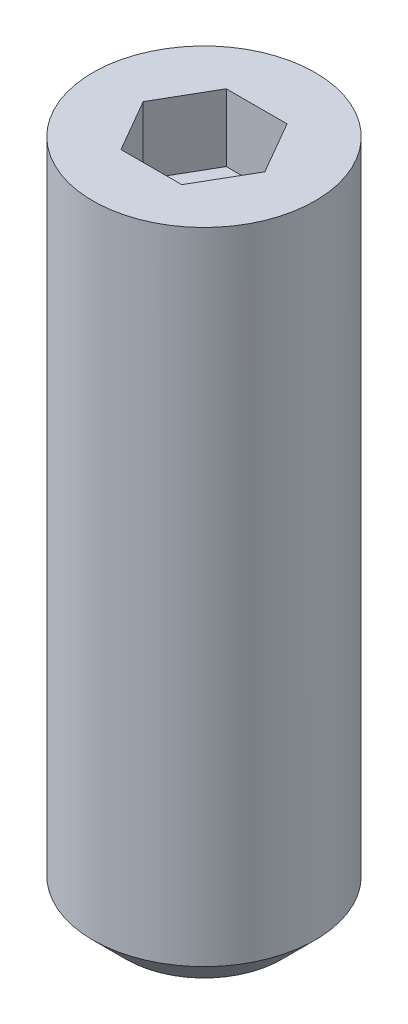
ISO-10303-21;
HEADER;
FILE_DESCRIPTION(('STEP AP214'),'2;1');
FILE_NAME('part.step','',(''),(''),'','','');
FILE_SCHEMA(('AUTOMOTIVE_DESIGN { 1 0 10303 214 1 1 1 1 }'));
ENDSEC;
DATA;
#1=APPLICATION_CONTEXT('core data for automotive mechanical design processes');
#2=APPLICATION_PROTOCOL_DEFINITION('international standard','automotive_design',2000,#1);
#3=PRODUCT_CONTEXT('',#1,'mechanical');
#4=PRODUCT('Part','Part','',(#3));
#5=PRODUCT_RELATED_PRODUCT_CATEGORY('part','',(#4));
#6=PRODUCT_DEFINITION_FORMATION('','',#4);
#7=PRODUCT_DEFINITION_CONTEXT('part definition',#1,'design');
#8=PRODUCT_DEFINITION('design','',#6,#7);
#9=PRODUCT_DEFINITION_SHAPE('','',#8);
#10=(LENGTH_UNIT() NAMED_UNIT(*) SI_UNIT(.MILLI.,.METRE.));
#11=(NAMED_UNIT(*) PLANE_ANGLE_UNIT() SI_UNIT($,.RADIAN.));
#12=(NAMED_UNIT(*) SI_UNIT($,.STERADIAN.) SOLID_ANGLE_UNIT());
#13=UNCERTAINTY_MEASURE_WITH_UNIT(LENGTH_MEASURE(1.E-05),#10,'distance_accuracy_value','');
#14=(GEOMETRIC_REPRESENTATION_CONTEXT(3) GLOBAL_UNCERTAINTY_ASSIGNED_CONTEXT((#13)) GLOBAL_UNIT_ASSIGNED_CONTEXT((#10,
#11,#12)) REPRESENTATION_CONTEXT('',''));
#15=CARTESIAN_POINT('',(0.,0.,0.));
#16=DIRECTION('',(0.,0.,1.));
#17=DIRECTION('',(1.,0.,0.));
#18=AXIS2_PLACEMENT_3D('',#15,#16,#17);
#19=CARTESIAN_POINT('',(-1.14567944042316,5.08,0.));
#20=DIRECTION('',(0.,1.,0.));
#21=DIRECTION('',(0.,0.,1.));
#22=AXIS2_PLACEMENT_3D('',#19,#20,#21);
#23=PLANE('',#22);
#24=DIRECTION('',(-0.5,0.,-0.866025403784438));
#25=VECTOR('',#24,1.);
#26=CARTESIAN_POINT('',(1.14567944042316,5.08,0.));
#27=LINE('',#26,#25);
#28=CARTESIAN_POINT('',(1.14567944042316,5.08,0.));
#29=VERTEX_POINT('',#28);
#30=CARTESIAN_POINT('',(0.572839720211582,5.08,-0.992187499999999));
#31=VERTEX_POINT('',#30);
#32=EDGE_CURVE('E68',#29,#31,#27,.T.);
#33=ORIENTED_EDGE('',*,*,#32,.T.);
#34=DIRECTION('',(-1.,0.,0.));
#35=VECTOR('',#34,1.);
#36=CARTESIAN_POINT('',(0.572839720211582,5.08,-0.992187499999999));
#37=LINE('',#36,#35);
#38=CARTESIAN_POINT('',(-0.572839720211583,5.08,-0.992187499999999));
#39=VERTEX_POINT('',#38);
#40=EDGE_CURVE('E70',#31,#39,#37,.T.);
#41=ORIENTED_EDGE('',*,*,#40,.T.);
#42=DIRECTION('',(-0.5,0.,0.866025403784439));
#43=VECTOR('',#42,1.);
#44=CARTESIAN_POINT('',(-0.572839720211583,5.08,-0.992187499999999));
#45=LINE('',#44,#43);
#46=CARTESIAN_POINT('',(-1.14567944042316,5.08,0.));
#47=VERTEX_POINT('',#46);
#48=EDGE_CURVE('E72',#39,#47,#45,.T.);
#49=ORIENTED_EDGE('',*,*,#48,.T.);
#50=DIRECTION('',(0.500000000000001,0.,0.866025403784438));
#51=VECTOR('',#50,1.);
#52=CARTESIAN_POINT('',(-1.14567944042316,5.08,0.));
#53=LINE('',#52,#51);
#54=CARTESIAN_POINT('',(-0.572839720211581,5.08,0.9921875));
#55=VERTEX_POINT('',#54);
#56=EDGE_CURVE('E118',#47,#55,#53,.T.);
#57=ORIENTED_EDGE('',*,*,#56,.T.);
#58=DIRECTION('',(1.,0.,0.));
#59=VECTOR('',#58,1.);
#60=CARTESIAN_POINT('',(-0.572839720211581,5.08,0.9921875));
#61=LINE('',#60,#59);
#62=CARTESIAN_POINT('',(0.572839720211582,5.08,0.9921875));
#63=VERTEX_POINT('',#62);
#64=EDGE_CURVE('E123',#55,#63,#61,.T.);
#65=ORIENTED_EDGE('',*,*,#64,.T.);
#66=DIRECTION('',(0.5,0.,-0.866025403784439));
#67=VECTOR('',#66,1.);
#68=CARTESIAN_POINT('',(0.572839720211582,5.08,0.9921875));
#69=LINE('',#68,#67);
#70=EDGE_CURVE('E127',#63,#29,#69,.T.);
#71=ORIENTED_EDGE('',*,*,#70,.T.);
#72=EDGE_LOOP('',(#33,#41,#49,#57,#65,#71));
#73=FACE_BOUND('',#72,.T.);
#74=ADVANCED_FACE('F17',(#73),#23,.T.);
#75=CARTESIAN_POINT('',(-0.572839720211583,5.08,-0.992187499999999));
#76=DIRECTION('',(-0.866025403784439,0.,-0.5));
#77=DIRECTION('',(-0.5,0.,0.866025403784439));
#78=AXIS2_PLACEMENT_3D('',#75,#76,#77);
#79=PLANE('',#78);
#80=DIRECTION('',(0.,1.,0.));
#81=VECTOR('',#80,1.);
#82=CARTESIAN_POINT('',(-1.14567944042316,5.08,0.));
#83=LINE('',#82,#81);
#84=CARTESIAN_POINT('',(-1.14567944042316,6.35,0.));
#85=VERTEX_POINT('',#84);
#86=EDGE_CURVE('E83',#85,#47,#83,.F.);
#87=ORIENTED_EDGE('',*,*,#86,.T.);
#88=ORIENTED_EDGE('',*,*,#48,.F.);
#89=DIRECTION('',(0.,1.,0.));
#90=VECTOR('',#89,1.);
#91=CARTESIAN_POINT('',(-0.572839720211583,5.08,-0.992187499999999));
#92=LINE('',#91,#90);
#93=CARTESIAN_POINT('',(-0.572839720211583,6.35,-0.992187499999999));
#94=VERTEX_POINT('',#93);
#95=EDGE_CURVE('E77',#39,#94,#92,.T.);
#96=ORIENTED_EDGE('',*,*,#95,.T.);
#97=DIRECTION('',(0.5,0.,-0.866025403784439));
#98=VECTOR('',#97,1.);
#99=CARTESIAN_POINT('',(-1.14567944042316,6.35,0.));
#100=LINE('',#99,#98);
#101=EDGE_CURVE('E115',#85,#94,#100,.T.);
#102=ORIENTED_EDGE('',*,*,#101,.F.);
#103=EDGE_LOOP('',(#87,#88,#96,#102));
#104=FACE_BOUND('',#103,.T.);
#105=ADVANCED_FACE('F80',(#104),#79,.F.);
#106=CARTESIAN_POINT('',(0.572839720211582,5.08,-0.992187499999999));
#107=DIRECTION('',(0.,0.,-1.));
#108=DIRECTION('',(-1.,0.,0.));
#109=AXIS2_PLACEMENT_3D('',#106,#107,#108);
#110=PLANE('',#109);
#111=ORIENTED_EDGE('',*,*,#95,.F.);
#112=ORIENTED_EDGE('',*,*,#40,.F.);
#113=DIRECTION('',(0.,1.,0.));
#114=VECTOR('',#113,1.);
#115=CARTESIAN_POINT('',(0.572839720211582,5.08,-0.992187499999999));
#116=LINE('',#115,#114);
#117=CARTESIAN_POINT('',(0.572839720211582,6.35,-0.992187499999999));
#118=VERTEX_POINT('',#117);
#119=EDGE_CURVE('E91',#31,#118,#116,.T.);
#120=ORIENTED_EDGE('',*,*,#119,.T.);
#121=DIRECTION('',(1.,0.,0.));
#122=VECTOR('',#121,1.);
#123=CARTESIAN_POINT('',(0.,6.35,-0.992187499999999));
#124=LINE('',#123,#122);
#125=EDGE_CURVE('E88',#94,#118,#124,.T.);
#126=ORIENTED_EDGE('',*,*,#125,.F.);
#127=EDGE_LOOP('',(#111,#112,#120,#126));
#128=FACE_BOUND('',#127,.T.);
#129=ADVANCED_FACE('F86',(#128),#110,.F.);
#130=CARTESIAN_POINT('',(1.14567944042316,5.08,0.));
#131=DIRECTION('',(0.866025403784438,0.,-0.5));
#132=DIRECTION('',(-0.5,0.,-0.866025403784438));
#133=AXIS2_PLACEMENT_3D('',#130,#131,#132);
#134=PLANE('',#133);
#135=ORIENTED_EDGE('',*,*,#119,.F.);
#136=ORIENTED_EDGE('',*,*,#32,.F.);
#137=DIRECTION('',(0.,1.,0.));
#138=VECTOR('',#137,1.);
#139=CARTESIAN_POINT('',(1.14567944042316,5.08,0.));
#140=LINE('',#139,#138);
#141=CARTESIAN_POINT('',(1.14567944042316,6.35,0.));
#142=VERTEX_POINT('',#141);
#143=EDGE_CURVE('E125',#29,#142,#140,.T.);
#144=ORIENTED_EDGE('',*,*,#143,.T.);
#145=DIRECTION('',(0.5,0.,0.866025403784438));
#146=VECTOR('',#145,1.);
#147=CARTESIAN_POINT('',(0.572839720211582,6.35,-0.992187499999999));
#148=LINE('',#147,#146);
#149=EDGE_CURVE('E111',#118,#142,#148,.T.);
#150=ORIENTED_EDGE('',*,*,#149,.F.);
#151=EDGE_LOOP('',(#135,#136,#144,#150));
#152=FACE_BOUND('',#151,.T.);
#153=ADVANCED_FACE('F130',(#152),#134,.F.);
#154=CARTESIAN_POINT('',(0.572839720211582,5.08,0.9921875));
#155=DIRECTION('',(0.866025403784439,0.,0.5));
#156=DIRECTION('',(0.5,0.,-0.866025403784439));
#157=AXIS2_PLACEMENT_3D('',#154,#155,#156);
#158=PLANE('',#157);
#159=ORIENTED_EDGE('',*,*,#143,.F.);
#160=ORIENTED_EDGE('',*,*,#70,.F.);
#161=DIRECTION('',(0.,1.,0.));
#162=VECTOR('',#161,1.);
#163=CARTESIAN_POINT('',(0.572839720211582,5.08,0.9921875));
#164=LINE('',#163,#162);
#165=CARTESIAN_POINT('',(0.572839720211582,6.35,0.9921875));
#166=VERTEX_POINT('',#165);
#167=EDGE_CURVE('E121',#63,#166,#164,.T.);
#168=ORIENTED_EDGE('',*,*,#167,.T.);
#169=DIRECTION('',(-0.5,0.,0.866025403784438));
#170=VECTOR('',#169,1.);
#171=CARTESIAN_POINT('',(1.14567944042316,6.35,0.));
#172=LINE('',#171,#170);
#173=EDGE_CURVE('E106',#142,#166,#172,.T.);
#174=ORIENTED_EDGE('',*,*,#173,.F.);
#175=EDGE_LOOP('',(#159,#160,#168,#174));
#176=FACE_BOUND('',#175,.T.);
#177=ADVANCED_FACE('F140',(#176),#158,.F.);
#178=CARTESIAN_POINT('',(-0.572839720211581,5.08,0.9921875));
#179=DIRECTION('',(0.,0.,1.));
#180=DIRECTION('',(1.,0.,0.));
#181=AXIS2_PLACEMENT_3D('',#178,#179,#180);
#182=PLANE('',#181);
#183=ORIENTED_EDGE('',*,*,#167,.F.);
#184=ORIENTED_EDGE('',*,*,#64,.F.);
#185=DIRECTION('',(0.,1.,0.));
#186=VECTOR('',#185,1.);
#187=CARTESIAN_POINT('',(-0.572839720211581,5.08,0.9921875));
#188=LINE('',#187,#186);
#189=CARTESIAN_POINT('',(-0.572839720211581,6.35,0.9921875));
#190=VERTEX_POINT('',#189);
#191=EDGE_CURVE('E35',#55,#190,#188,.T.);
#192=ORIENTED_EDGE('',*,*,#191,.T.);
#193=DIRECTION('',(1.,0.,0.));
#194=VECTOR('',#193,1.);
#195=CARTESIAN_POINT('',(0.,6.35,0.9921875));
#196=LINE('',#195,#194);
#197=EDGE_CURVE('E102',#166,#190,#196,.F.);
#198=ORIENTED_EDGE('',*,*,#197,.F.);
#199=EDGE_LOOP('',(#183,#184,#192,#198));
#200=FACE_BOUND('',#199,.T.);
#201=ADVANCED_FACE('F138',(#200),#182,.F.);
#202=CARTESIAN_POINT('',(-1.14567944042316,5.08,0.));
#203=DIRECTION('',(-0.866025403784438,0.,0.500000000000001));
#204=DIRECTION('',(0.500000000000001,0.,0.866025403784438));
#205=AXIS2_PLACEMENT_3D('',#202,#203,#204);
#206=PLANE('',#205);
#207=ORIENTED_EDGE('',*,*,#191,.F.);
#208=ORIENTED_EDGE('',*,*,#56,.F.);
#209=ORIENTED_EDGE('',*,*,#86,.F.);
#210=DIRECTION('',(-0.5,0.,-0.866025403784438));
#211=VECTOR('',#210,1.);
#212=CARTESIAN_POINT('',(-0.572839720211581,6.35,0.9921875));
#213=LINE('',#212,#211);
#214=EDGE_CURVE('E98',#190,#85,#213,.T.);
#215=ORIENTED_EDGE('',*,*,#214,.F.);
#216=EDGE_LOOP('',(#207,#208,#209,#215));
#217=FACE_BOUND('',#216,.T.);
#218=ADVANCED_FACE('F135',(#217),#206,.F.);
#219=CARTESIAN_POINT('',(0.,-6.35,0.));
#220=DIRECTION('',(0.,1.,0.));
#221=DIRECTION('',(0.,0.,1.));
#222=AXIS2_PLACEMENT_3D('',#219,#220,#221);
#223=PLANE('',#222);
#224=CARTESIAN_POINT('',(0.,-6.34999999994079,0.));
#225=DIRECTION('',(0.,1.,0.));
#226=DIRECTION('',(0.,0.,1.));
#227=AXIS2_PLACEMENT_3D('',#224,#225,#226);
#228=CIRCLE('',#227,1.46050000000741);
#229=CARTESIAN_POINT('',(0.,-6.34999999994079,1.46050000000741));
#230=VERTEX_POINT('',#229);
#231=EDGE_CURVE('E20',#230,#230,#228,.T.);
#232=ORIENTED_EDGE('',*,*,#231,.F.);
#233=EDGE_LOOP('',(#232));
#234=FACE_BOUND('',#233,.T.);
#235=ADVANCED_FACE('F163',(#234),#223,.F.);
#236=CARTESIAN_POINT('',(0.,6.35,0.));
#237=DIRECTION('',(0.,1.,0.));
#238=DIRECTION('',(0.,0.,1.));
#239=AXIS2_PLACEMENT_3D('',#236,#237,#238);
#240=PLANE('',#239);
#241=CARTESIAN_POINT('',(0.,6.35,0.));
#242=DIRECTION('',(0.,-1.,0.));
#243=DIRECTION('',(0.,0.,-1.));
#244=AXIS2_PLACEMENT_3D('',#241,#242,#243);
#245=CIRCLE('',#244,2.0955);
#246=CARTESIAN_POINT('',(0.,6.35,-2.0955));
#247=VERTEX_POINT('',#246);
#248=EDGE_CURVE('E26',#247,#247,#245,.T.);
#249=ORIENTED_EDGE('',*,*,#248,.F.);
#250=EDGE_LOOP('',(#249));
#251=FACE_BOUND('',#250,.T.);
#252=ORIENTED_EDGE('',*,*,#197,.T.);
#253=ORIENTED_EDGE('',*,*,#214,.T.);
#254=ORIENTED_EDGE('',*,*,#101,.T.);
#255=ORIENTED_EDGE('',*,*,#125,.T.);
#256=ORIENTED_EDGE('',*,*,#149,.T.);
#257=ORIENTED_EDGE('',*,*,#173,.T.);
#258=EDGE_LOOP('',(#252,#253,#254,#255,#256,#257));
#259=FACE_BOUND('',#258,.T.);
#260=ADVANCED_FACE('F133',(#251,#259),#240,.T.);
#261=CARTESIAN_POINT('',(0.,-5.71500000000924,0.));
#262=DIRECTION('',(0.,1.,0.));
#263=DIRECTION('',(0.,0.,1.));
#264=AXIS2_PLACEMENT_3D('',#261,#262,#263);
#265=CONICAL_SURFACE('',#264,2.09549999993897,0.785398163397448);
#266=CARTESIAN_POINT('',(0.,-5.715,0.));
#267=DIRECTION('',(0.,-1.,0.));
#268=DIRECTION('',(0.,0.,-1.));
#269=AXIS2_PLACEMENT_3D('',#266,#267,#268);
#270=CIRCLE('',#269,2.0955);
#271=CARTESIAN_POINT('',(0.,-5.715,-2.0955));
#272=VERTEX_POINT('',#271);
#273=EDGE_CURVE('E10',#272,#272,#270,.F.);
#274=ORIENTED_EDGE('',*,*,#273,.F.);
#275=EDGE_LOOP('',(#274));
#276=FACE_BOUND('',#275,.T.);
#277=ORIENTED_EDGE('',*,*,#231,.T.);
#278=EDGE_LOOP('',(#277));
#279=FACE_BOUND('',#278,.T.);
#280=ADVANCED_FACE('F152',(#276,#279),#265,.T.);
#281=CARTESIAN_POINT('',(0.,6.35,0.));
#282=DIRECTION('',(0.,-1.,0.));
#283=DIRECTION('',(0.,0.,-1.));
#284=AXIS2_PLACEMENT_3D('',#281,#282,#283);
#285=CYLINDRICAL_SURFACE('',#284,2.0955);
#286=ORIENTED_EDGE('',*,*,#273,.T.);
#287=EDGE_LOOP('',(#286));
#288=FACE_BOUND('',#287,.T.);
#289=ORIENTED_EDGE('',*,*,#248,.T.);
#290=EDGE_LOOP('',(#289));
#291=FACE_BOUND('',#290,.T.);
#292=ADVANCED_FACE('F150',(#288,#291),#285,.T.);
#293=CLOSED_SHELL('',(#74,#105,#129,#153,#177,#201,#218,#235,#260,#280,#292));
#294=MANIFOLD_SOLID_BREP('B1',#293);
#295=ADVANCED_BREP_SHAPE_REPRESENTATION('',(#18,#294),#14);
#296=SHAPE_DEFINITION_REPRESENTATION(#9,#295);
ENDSEC;
END-ISO-10303-21;
